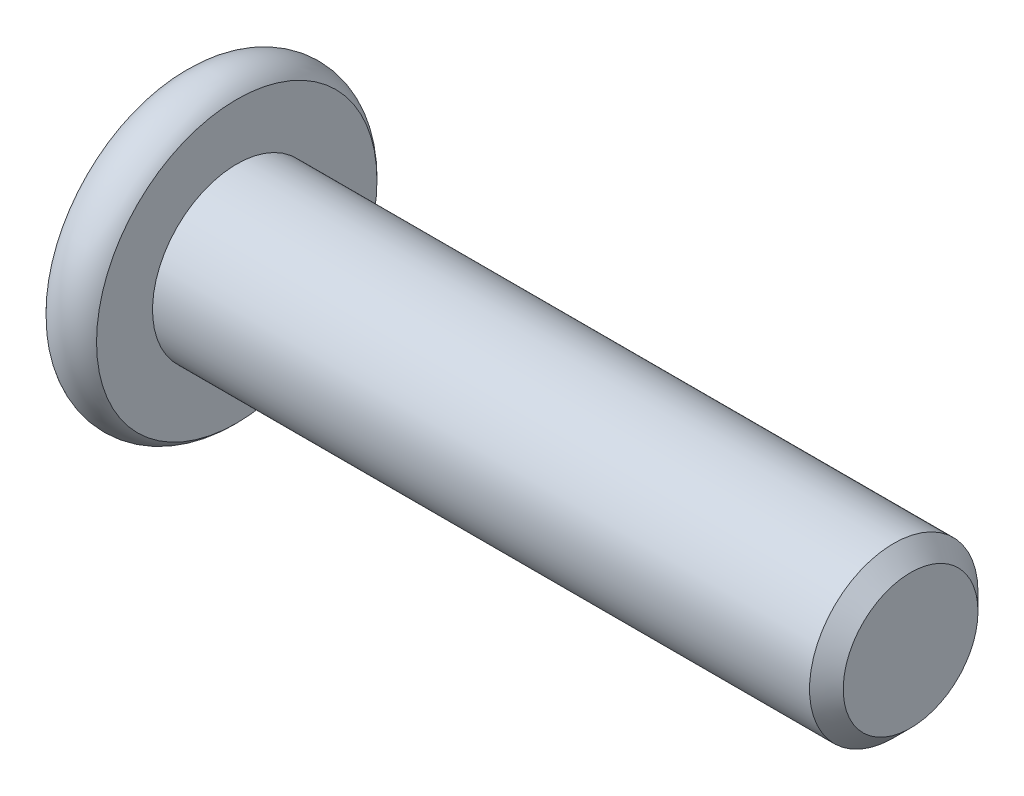
ISO-10303-21;
HEADER;
FILE_DESCRIPTION(('STEP AP214'),'2;1');
FILE_NAME('part.step','',(''),(''),'','','');
FILE_SCHEMA(('AUTOMOTIVE_DESIGN { 1 0 10303 214 1 1 1 1 }'));
ENDSEC;
DATA;
#1=APPLICATION_CONTEXT('core data for automotive mechanical design processes');
#2=APPLICATION_PROTOCOL_DEFINITION('international standard','automotive_design',2000,#1);
#3=PRODUCT_CONTEXT('',#1,'mechanical');
#4=PRODUCT('Part','Part','',(#3));
#5=PRODUCT_RELATED_PRODUCT_CATEGORY('part','',(#4));
#6=PRODUCT_DEFINITION_FORMATION('','',#4);
#7=PRODUCT_DEFINITION_CONTEXT('part definition',#1,'design');
#8=PRODUCT_DEFINITION('design','',#6,#7);
#9=PRODUCT_DEFINITION_SHAPE('','',#8);
#10=(LENGTH_UNIT() NAMED_UNIT(*) SI_UNIT(.MILLI.,.METRE.));
#11=(NAMED_UNIT(*) PLANE_ANGLE_UNIT() SI_UNIT($,.RADIAN.));
#12=(NAMED_UNIT(*) SI_UNIT($,.STERADIAN.) SOLID_ANGLE_UNIT());
#13=UNCERTAINTY_MEASURE_WITH_UNIT(LENGTH_MEASURE(1.E-05),#10,'distance_accuracy_value','');
#14=(GEOMETRIC_REPRESENTATION_CONTEXT(3) GLOBAL_UNCERTAINTY_ASSIGNED_CONTEXT((#13)) GLOBAL_UNIT_ASSIGNED_CONTEXT((#10,
#11,#12)) REPRESENTATION_CONTEXT('',''));
#15=CARTESIAN_POINT('',(0.,0.,0.));
#16=DIRECTION('',(0.,0.,1.));
#17=DIRECTION('',(1.,0.,0.));
#18=AXIS2_PLACEMENT_3D('',#15,#16,#17);
#19=CARTESIAN_POINT('',(-20.,0.,0.));
#20=DIRECTION('',(1.,0.,0.));
#21=DIRECTION('',(0.,0.,-1.));
#22=AXIS2_PLACEMENT_3D('',#19,#20,#21);
#23=CYLINDRICAL_SURFACE('',#22,2.5);
#24=CARTESIAN_POINT('',(-0.5,0.,0.));
#25=DIRECTION('',(1.,0.,0.));
#26=DIRECTION('',(0.,0.,-1.));
#27=AXIS2_PLACEMENT_3D('',#24,#25,#26);
#28=CIRCLE('',#27,2.5);
#29=CARTESIAN_POINT('',(-0.5,0.,-2.5));
#30=VERTEX_POINT('',#29);
#31=EDGE_CURVE('E47',#30,#30,#28,.F.);
#32=ORIENTED_EDGE('',*,*,#31,.T.);
#33=EDGE_LOOP('',(#32));
#34=FACE_BOUND('',#33,.T.);
#35=CARTESIAN_POINT('',(-20.,0.,0.));
#36=DIRECTION('',(-1.,0.,0.));
#37=DIRECTION('',(0.,-1.,0.));
#38=AXIS2_PLACEMENT_3D('',#35,#36,#37);
#39=CIRCLE('',#38,2.5);
#40=CARTESIAN_POINT('',(-20.,-2.50000000000001,0.));
#41=VERTEX_POINT('',#40);
#42=EDGE_CURVE('E123',#41,#41,#39,.F.);
#43=ORIENTED_EDGE('',*,*,#42,.T.);
#44=EDGE_LOOP('',(#43));
#45=FACE_BOUND('',#44,.T.);
#46=ADVANCED_FACE('F34',(#34,#45),#23,.T.);
#47=CARTESIAN_POINT('',(0.,0.,0.));
#48=DIRECTION('',(1.,0.,0.));
#49=DIRECTION('',(0.,0.,-1.));
#50=AXIS2_PLACEMENT_3D('',#47,#48,#49);
#51=PLANE('',#50);
#52=CARTESIAN_POINT('',(0.,0.,0.));
#53=DIRECTION('',(1.,0.,0.));
#54=DIRECTION('',(0.,0.,-1.));
#55=AXIS2_PLACEMENT_3D('',#52,#53,#54);
#56=CIRCLE('',#55,2.);
#57=CARTESIAN_POINT('',(0.,0.,-2.));
#58=VERTEX_POINT('',#57);
#59=EDGE_CURVE('E126',#58,#58,#56,.T.);
#60=ORIENTED_EDGE('',*,*,#59,.T.);
#61=EDGE_LOOP('',(#60));
#62=FACE_BOUND('',#61,.T.);
#63=ADVANCED_FACE('F136',(#62),#51,.T.);
#64=CARTESIAN_POINT('',(0.,0.,0.));
#65=DIRECTION('',(-1.,0.,0.));
#66=DIRECTION('',(0.,0.,1.));
#67=AXIS2_PLACEMENT_3D('',#64,#65,#66);
#68=CONICAL_SURFACE('',#67,2.,0.785398163397446);
#69=ORIENTED_EDGE('',*,*,#31,.F.);
#70=EDGE_LOOP('',(#69));
#71=FACE_BOUND('',#70,.T.);
#72=ORIENTED_EDGE('',*,*,#59,.F.);
#73=EDGE_LOOP('',(#72));
#74=FACE_BOUND('',#73,.T.);
#75=ADVANCED_FACE('F36',(#71,#74),#68,.T.);
#76=CARTESIAN_POINT('',(-21.5,0.,0.));
#77=DIRECTION('',(1.,0.,0.));
#78=DIRECTION('',(0.,1.,0.));
#79=AXIS2_PLACEMENT_3D('',#76,#77,#78);
#80=PLANE('',#79);
#81=CARTESIAN_POINT('',(-21.5,0.,0.));
#82=DIRECTION('',(-1.,0.,0.));
#83=DIRECTION('',(0.,-1.,0.));
#84=AXIS2_PLACEMENT_3D('',#81,#82,#83);
#85=CIRCLE('',#84,1.78205080756886);
#86=CARTESIAN_POINT('',(-21.5,-1.78205080756877,0.));
#87=VERTEX_POINT('',#86);
#88=EDGE_CURVE('E236',#87,#87,#85,.T.);
#89=ORIENTED_EDGE('',*,*,#88,.F.);
#90=EDGE_LOOP('',(#89));
#91=FACE_BOUND('',#90,.T.);
#92=CARTESIAN_POINT('',(-21.5,0.,0.));
#93=DIRECTION('',(-1.,0.,0.));
#94=DIRECTION('',(0.,-1.,0.));
#95=AXIS2_PLACEMENT_3D('',#92,#93,#94);
#96=CIRCLE('',#95,4.16143782776615);
#97=CARTESIAN_POINT('',(-21.5,-4.16143782776614,0.));
#98=VERTEX_POINT('',#97);
#99=EDGE_CURVE('E120',#98,#98,#96,.T.);
#100=ORIENTED_EDGE('',*,*,#99,.T.);
#101=EDGE_LOOP('',(#100));
#102=FACE_BOUND('',#101,.T.);
#103=ADVANCED_FACE('F135',(#91,#102),#80,.F.);
#104=CARTESIAN_POINT('',(-20.75,0.,0.));
#105=DIRECTION('',(-1.,0.,0.));
#106=DIRECTION('',(0.,-1.,0.));
#107=AXIS2_PLACEMENT_3D('',#104,#105,#106);
#108=TOROIDAL_SURFACE('',#107,3.5,1.);
#109=ORIENTED_EDGE('',*,*,#99,.F.);
#110=EDGE_LOOP('',(#109));
#111=FACE_BOUND('',#110,.T.);
#112=CARTESIAN_POINT('',(-20.,0.,0.));
#113=DIRECTION('',(-1.,0.,0.));
#114=DIRECTION('',(0.,-1.,0.));
#115=AXIS2_PLACEMENT_3D('',#112,#113,#114);
#116=CIRCLE('',#115,4.16143782776615);
#117=CARTESIAN_POINT('',(-20.,-4.16143782776615,0.));
#118=VERTEX_POINT('',#117);
#119=EDGE_CURVE('E117',#118,#118,#116,.T.);
#120=ORIENTED_EDGE('',*,*,#119,.T.);
#121=EDGE_LOOP('',(#120));
#122=FACE_BOUND('',#121,.T.);
#123=ADVANCED_FACE('F147',(#111,#122),#108,.T.);
#124=CARTESIAN_POINT('',(-20.,4.16143782776615,0.));
#125=DIRECTION('',(-1.,0.,0.));
#126=DIRECTION('',(0.,-1.,0.));
#127=AXIS2_PLACEMENT_3D('',#124,#125,#126);
#128=PLANE('',#127);
#129=ORIENTED_EDGE('',*,*,#42,.F.);
#130=EDGE_LOOP('',(#129));
#131=FACE_BOUND('',#130,.T.);
#132=ORIENTED_EDGE('',*,*,#119,.F.);
#133=EDGE_LOOP('',(#132));
#134=FACE_BOUND('',#133,.T.);
#135=ADVANCED_FACE('F151',(#131,#134),#128,.F.);
#136=CARTESIAN_POINT('',(-21.5,0.,0.));
#137=DIRECTION('',(-1.,0.,0.));
#138=DIRECTION('',(0.,-1.,0.));
#139=AXIS2_PLACEMENT_3D('',#136,#137,#138);
#140=CONICAL_SURFACE('',#139,1.78205080756886,0.78539816339745);
#141=ORIENTED_EDGE('',*,*,#88,.T.);
#142=EDGE_LOOP('',(#141));
#143=FACE_BOUND('',#142,.T.);
#144=CARTESIAN_POINT('',(-22.015428085613,-1.74023253176573,1.5));
#145=CARTESIAN_POINT('',(-21.9833811073445,-1.69791724929727,1.5));
#146=CARTESIAN_POINT('',(-21.9516444672841,-1.65536760966788,1.5));
#147=CARTESIAN_POINT('',(-21.8889203936153,-1.56970398156681,1.5));
#148=CARTESIAN_POINT('',(-21.85793314822,-1.52658985542845,1.5));
#149=CARTESIAN_POINT('',(-21.765846164345,-1.39562626326559,1.5));
#150=CARTESIAN_POINT('',(-21.7061145123021,-1.30679868010572,1.5));
#151=CARTESIAN_POINT('',(-21.5887342891012,-1.12044622640211,1.5));
#152=CARTESIAN_POINT('',(-21.5314082774823,-1.02271587306669,1.5));
#153=CARTESIAN_POINT('',(-21.426463214976,-0.822357214965219,1.5));
#154=CARTESIAN_POINT('',(-21.3788114236896,-0.719746931701882,1.5));
#155=CARTESIAN_POINT('',(-21.320509988315,-0.565852387095054,1.5));
#156=CARTESIAN_POINT('',(-21.3037990535409,-0.516874191424642,1.5));
#157=CARTESIAN_POINT('',(-21.2743077515089,-0.41772398845748,1.5));
#158=CARTESIAN_POINT('',(-21.2615276514219,-0.367551900263847,1.5));
#159=CARTESIAN_POINT('',(-21.2407784202458,-0.267158299056097,1.5));
#160=CARTESIAN_POINT('',(-21.2327260618259,-0.216954261864833,1.5));
#161=CARTESIAN_POINT('',(-21.221591636834,-0.115994915871297,1.5));
#162=CARTESIAN_POINT('',(-21.2185086886377,-0.0652397064615148,1.5));
#163=CARTESIAN_POINT('',(-21.2175473897404,0.0344222234875812,1.5));
#164=CARTESIAN_POINT('',(-21.2194789216952,0.0833271701101152,1.5));
#165=CARTESIAN_POINT('',(-21.2280175729677,0.180724293127248,1.5));
#166=CARTESIAN_POINT('',(-21.234625142048,0.229216429361756,1.5));
#167=CARTESIAN_POINT('',(-21.2522650626447,0.326258027697034,1.5));
#168=CARTESIAN_POINT('',(-21.263373168201,0.374793507450053,1.5));
#169=CARTESIAN_POINT('',(-21.2894198669595,0.470802295834207,1.5));
#170=CARTESIAN_POINT('',(-21.3043581560035,0.518275688481311,1.5));
#171=CARTESIAN_POINT('',(-21.356839545716,0.667150562065161,1.5));
#172=CARTESIAN_POINT('',(-21.4003351165442,0.766448362426881,1.5));
#173=CARTESIAN_POINT('',(-21.4970587814836,0.960384405673869,1.5));
#174=CARTESIAN_POINT('',(-21.5503217226675,1.05500437383624,1.5));
#175=CARTESIAN_POINT('',(-21.6602258010453,1.23584520321535,1.5));
#176=CARTESIAN_POINT('',(-21.7165682531046,1.32224986946553,1.5));
#177=CARTESIAN_POINT('',(-21.803675572597,1.44954953726477,1.5));
#178=CARTESIAN_POINT('',(-21.8330199906839,1.49143368482427,1.5));
#179=CARTESIAN_POINT('',(-21.8924869182931,1.57462914783248,1.5));
#180=CARTESIAN_POINT('',(-21.9226092115007,1.61594061772583,1.5));
#181=CARTESIAN_POINT('',(-21.9530541181366,1.65701358742556,1.5));
#182=B_SPLINE_CURVE_WITH_KNOTS('',3,(#144,#145,#146,#147,#148,#149,#150,#151,#152,#153,#154,
#155,#156,#157,#158,#159,#160,#161,#162,#163,#164,#165,#166,#167,#168,#169,#170,#171,#172,#173,
#174,#175,#176,#177,#178,#179,#180,#181),.UNSPECIFIED.,.F.,.F.,(4,2,2,2,2,2,2,2,2,2,2,2,2,2,2,2,
2,2,4),(0.,0.159238974218354,0.318517535014543,0.639504781932386,0.979137893799193,
1.31760168934357,1.47272233841624,1.62785352839775,1.78016486537346,1.93244917778279,
2.07904486260297,2.22565464958332,2.37484213303399,2.52401777304039,2.84828365283775,
3.1737297566675,3.48303030530537,3.63644667013909,3.78982082222913),.UNSPECIFIED.);
#183=CARTESIAN_POINT('',(-21.45,-0.866025403784357,1.5));
#184=VERTEX_POINT('',#183);
#185=CARTESIAN_POINT('',(-21.45,0.866025403784521,1.5));
#186=VERTEX_POINT('',#185);
#187=EDGE_CURVE('E101',#184,#186,#182,.T.);
#188=ORIENTED_EDGE('',*,*,#187,.F.);
#189=CARTESIAN_POINT('',(-21.4501154816001,-1.73216627762263,-0.0002000000000008));
#190=CARTESIAN_POINT('',(-21.4203654760674,-1.70239359975907,0.0513677907370744));
#191=CARTESIAN_POINT('',(-21.3923624839103,-1.67212305186347,0.103797917665199));
#192=CARTESIAN_POINT('',(-21.3410892304402,-1.61039789003611,0.210709034055595));
#193=CARTESIAN_POINT('',(-21.3178475050444,-1.57893740312606,0.26520019581466));
#194=CARTESIAN_POINT('',(-21.2780337289922,-1.51549879897979,0.375079081357248));
#195=CARTESIAN_POINT('',(-21.2613615856709,-1.48353684526802,0.430438809095199));
#196=CARTESIAN_POINT('',(-21.2356744568181,-1.41890915196203,0.54237725747715));
#197=CARTESIAN_POINT('',(-21.2266402904789,-1.3862453878111,0.598952556553009));
#198=CARTESIAN_POINT('',(-21.2184890812269,-1.32995210095291,0.696455389516442));
#199=CARTESIAN_POINT('',(-21.2172822529892,-1.30639533311116,0.737256908280467));
#200=CARTESIAN_POINT('',(-21.2193140571623,-1.25932335290185,0.818787969615859));
#201=CARTESIAN_POINT('',(-21.2225536707483,-1.23580815085305,0.859517494314631));
#202=CARTESIAN_POINT('',(-21.233291985982,-1.18900414978418,0.940584402163417));
#203=CARTESIAN_POINT('',(-21.2407946530188,-1.16571558211711,0.980921384598289));
#204=CARTESIAN_POINT('',(-21.2596516119283,-1.11952932016327,1.06091833691403));
#205=CARTESIAN_POINT('',(-21.2710075570186,-1.09663179808778,1.10057800851621));
#206=CARTESIAN_POINT('',(-21.3047216475927,-1.0379815980969,1.20216313477449));
#207=CARTESIAN_POINT('',(-21.3296218490934,-1.00259267147457,1.26345855370969));
#208=CARTESIAN_POINT('',(-21.3716566532716,-0.950557780604292,1.35358562846331));
#209=CARTESIAN_POINT('',(-21.3864251535591,-0.933410759677065,1.38328513990772));
#210=CARTESIAN_POINT('',(-21.4173105659402,-0.899432101996325,1.44213790138375));
#211=CARTESIAN_POINT('',(-21.4334268341217,-0.882600319285629,1.47129140422064));
#212=CARTESIAN_POINT('',(-21.4501154816001,-0.865909933730519,1.5002));
#213=B_SPLINE_CURVE_WITH_KNOTS('',3,(#189,#190,#191,#192,#193,#194,#195,#196,#197,#198,#199,
#200,#201,#202,#203,#204,#205,#206,#207,#208,#209,#210,#211,#212),.UNSPECIFIED.,.F.,.F.,(4,2,2,
2,2,2,2,2,2,2,2,4),(0.,0.199829143693305,0.400822987382389,0.598623720538181,0.795926240188891,
0.937113067959883,1.07833105577193,1.21968061668222,1.36109089931055,1.58570969637566,
1.69770705470964,1.80965120737194),.UNSPECIFIED.);
#214=CARTESIAN_POINT('',(-21.45,-1.73205080756879,0.));
#215=VERTEX_POINT('',#214);
#216=EDGE_CURVE('E193',#215,#184,#213,.T.);
#217=ORIENTED_EDGE('',*,*,#216,.F.);
#218=CARTESIAN_POINT('',(-21.4501154816001,-0.865909933730519,-1.5002));
#219=CARTESIAN_POINT('',(-21.4203654760674,-0.895682611594084,-1.44863220926292));
#220=CARTESIAN_POINT('',(-21.3923624839103,-0.925953159489683,-1.3962020823348));
#221=CARTESIAN_POINT('',(-21.3410892304402,-0.987678321317041,-1.2892909659444));
#222=CARTESIAN_POINT('',(-21.3178475050444,-1.01913880822709,-1.23479980418534));
#223=CARTESIAN_POINT('',(-21.2780337289922,-1.08257741237336,-1.12492091864275));
#224=CARTESIAN_POINT('',(-21.2613615856709,-1.11453936608513,-1.0695611909048));
#225=CARTESIAN_POINT('',(-21.2356744568181,-1.17916705939112,-0.957622742522851));
#226=CARTESIAN_POINT('',(-21.2266402904789,-1.21183082354205,-0.901047443446993));
#227=CARTESIAN_POINT('',(-21.2184890812269,-1.26812411040024,-0.80354461048356));
#228=CARTESIAN_POINT('',(-21.2172822529892,-1.291680878242,-0.762743091719535));
#229=CARTESIAN_POINT('',(-21.2193140571623,-1.3387528584513,-0.681212030384143));
#230=CARTESIAN_POINT('',(-21.2225536707483,-1.3622680605001,-0.640482505685371));
#231=CARTESIAN_POINT('',(-21.233291985982,-1.40907206156897,-0.559415597836585));
#232=CARTESIAN_POINT('',(-21.2407946530188,-1.43236062923604,-0.519078615401714));
#233=CARTESIAN_POINT('',(-21.2596516119283,-1.47854689118988,-0.439081663085971));
#234=CARTESIAN_POINT('',(-21.2710075570186,-1.50144441326537,-0.399421991483794));
#235=CARTESIAN_POINT('',(-21.3047216475927,-1.56009461325625,-0.297836865225517));
#236=CARTESIAN_POINT('',(-21.3296218490934,-1.59548353987858,-0.236541446290313));
#237=CARTESIAN_POINT('',(-21.3716566532716,-1.64751843074886,-0.146414371536688));
#238=CARTESIAN_POINT('',(-21.3864251535591,-1.66466545167609,-0.116714860092285));
#239=CARTESIAN_POINT('',(-21.4173105659402,-1.69864410935683,-0.0578620986162509));
#240=CARTESIAN_POINT('',(-21.4334268341217,-1.71547589206752,-0.0287085957793639));
#241=CARTESIAN_POINT('',(-21.4501154816001,-1.73216627762263,0.00019999999999943));
#242=B_SPLINE_CURVE_WITH_KNOTS('',3,(#218,#219,#220,#221,#222,#223,#224,#225,#226,#227,#228,
#229,#230,#231,#232,#233,#234,#235,#236,#237,#238,#239,#240,#241),.UNSPECIFIED.,.F.,.F.,(4,2,2,
2,2,2,2,2,2,2,2,4),(0.,0.199829143693304,0.400822987382386,0.598623720538178,0.795926240188888,
0.937113067959879,1.07833105577193,1.21968061668222,1.36109089931054,1.58570969637565,
1.69770705470963,1.80965120737194),.UNSPECIFIED.);
#243=CARTESIAN_POINT('',(-21.45,-0.866025403784356,-1.5));
#244=VERTEX_POINT('',#243);
#245=EDGE_CURVE('E188',#244,#215,#242,.T.);
#246=ORIENTED_EDGE('',*,*,#245,.F.);
#247=CARTESIAN_POINT('',(-22.0154280857208,-1.74023253190806,-1.5));
#248=CARTESIAN_POINT('',(-21.9833811074482,-1.69791724943558,-1.5));
#249=CARTESIAN_POINT('',(-21.9516444673836,-1.65536760980217,-1.5));
#250=CARTESIAN_POINT('',(-21.8889203937065,-1.569703981693,-1.5));
#251=CARTESIAN_POINT('',(-21.8579331483071,-1.52658985555058,-1.5));
#252=CARTESIAN_POINT('',(-21.7658461644196,-1.39562626337528,-1.5));
#253=CARTESIAN_POINT('',(-21.7061145123685,-1.30679868020694,-1.5));
#254=CARTESIAN_POINT('',(-21.5887342891506,-1.12044622648488,-1.5));
#255=CARTESIAN_POINT('',(-21.5314082775229,-1.02271587313942,-1.5));
#256=CARTESIAN_POINT('',(-21.4264632150005,-0.822357215017008,-1.5));
#257=CARTESIAN_POINT('',(-21.3788114237068,-0.719746931742781,-1.5));
#258=CARTESIAN_POINT('',(-21.3205099883267,-0.565852387127772,-1.5));
#259=CARTESIAN_POINT('',(-21.3037990535528,-0.516874191460807,-1.5));
#260=CARTESIAN_POINT('',(-21.2743077515206,-0.417723988500656,-1.5));
#261=CARTESIAN_POINT('',(-21.2615276514332,-0.367551900310585,-1.5));
#262=CARTESIAN_POINT('',(-21.2407784202553,-0.267158299109846,-1.5));
#263=CARTESIAN_POINT('',(-21.2327260618343,-0.216954261922027,-1.5));
#264=CARTESIAN_POINT('',(-21.2215916368391,-0.11599491593527,-1.5));
#265=CARTESIAN_POINT('',(-21.2185086886407,-0.0652397065288216,-1.5));
#266=CARTESIAN_POINT('',(-21.2175473897388,0.0344222234142057,-1.5));
#267=CARTESIAN_POINT('',(-21.219478921691,0.0833271700339959,-1.5));
#268=CARTESIAN_POINT('',(-21.228017572958,0.18072429304592,-1.5));
#269=CARTESIAN_POINT('',(-21.2346251420354,0.229216429277964,-1.5));
#270=CARTESIAN_POINT('',(-21.2522650626259,0.326258027608378,-1.5));
#271=CARTESIAN_POINT('',(-21.2633731681789,0.374793507359005,-1.5));
#272=CARTESIAN_POINT('',(-21.2894198669309,0.470802295738608,-1.5));
#273=CARTESIAN_POINT('',(-21.3043581559716,0.518275688383553,-1.5));
#274=CARTESIAN_POINT('',(-21.3568395456685,0.667150561946207,-1.5));
#275=CARTESIAN_POINT('',(-21.4003351164824,0.766448362289951,-1.5));
#276=CARTESIAN_POINT('',(-21.4970587813916,0.960384405502367,-1.5));
#277=CARTESIAN_POINT('',(-21.5503217225595,1.05500437364815,-1.5));
#278=CARTESIAN_POINT('',(-21.6602258009069,1.23584520299745,-1.5));
#279=CARTESIAN_POINT('',(-21.7165682529518,1.32224986923429,-1.5));
#280=CARTESIAN_POINT('',(-21.8036755724226,1.44954953701381,-1.5));
#281=CARTESIAN_POINT('',(-21.8330199905024,1.49143368456684,-1.5));
#282=CARTESIAN_POINT('',(-21.8924869180973,1.57462914756214,-1.5));
#283=CARTESIAN_POINT('',(-21.9226092112979,1.61594061744905,-1.5));
#284=CARTESIAN_POINT('',(-21.9530541179266,1.65701358714236,-1.5));
#285=B_SPLINE_CURVE_WITH_KNOTS('',3,(#247,#248,#249,#250,#251,#252,#253,#254,#255,#256,#257,
#258,#259,#260,#261,#262,#263,#264,#265,#266,#267,#268,#269,#270,#271,#272,#273,#274,#275,#276,
#277,#278,#279,#280,#281,#282,#283,#284),.UNSPECIFIED.,.F.,.F.,(4,2,2,2,2,2,2,2,2,2,2,2,2,2,2,2,
2,2,4),(0.,0.159238974235481,0.318517535048797,0.63950478200154,0.979137893907506,
1.31760168949067,1.47272233855334,1.62785352852489,1.78016486549104,1.93244917789081,
2.0790448627025,2.22565464967435,2.37484213311584,2.52401777311309,2.8482836528441,
3.17372975660706,3.4830303051878,3.63644666999334,3.78982082205521),.UNSPECIFIED.);
#286=CARTESIAN_POINT('',(-21.45,0.866025403784521,-1.5));
#287=VERTEX_POINT('',#286);
#288=EDGE_CURVE('E54',#287,#244,#285,.F.);
#289=ORIENTED_EDGE('',*,*,#288,.F.);
#290=CARTESIAN_POINT('',(-21.4501154816001,1.7321662776228,0.00020000000000003));
#291=CARTESIAN_POINT('',(-21.4203654760673,1.70239359975923,-0.0513677907370759));
#292=CARTESIAN_POINT('',(-21.3923624839103,1.67212305186363,-0.103797917665201));
#293=CARTESIAN_POINT('',(-21.3410892304402,1.61039789003627,-0.210709034055597));
#294=CARTESIAN_POINT('',(-21.3178475050444,1.57893740312622,-0.265200195814661));
#295=CARTESIAN_POINT('',(-21.2780337289922,1.51549879897995,-0.375079081357247));
#296=CARTESIAN_POINT('',(-21.2613615856709,1.48353684526818,-0.430438809095198));
#297=CARTESIAN_POINT('',(-21.2356744568181,1.4189091519622,-0.542377257477149));
#298=CARTESIAN_POINT('',(-21.2266402904789,1.38624538781127,-0.598952556553007));
#299=CARTESIAN_POINT('',(-21.2184890812269,1.32995210095308,-0.696455389516439));
#300=CARTESIAN_POINT('',(-21.2172822529892,1.30639533311132,-0.737256908280464));
#301=CARTESIAN_POINT('',(-21.2193140571623,1.25932335290202,-0.818787969615856));
#302=CARTESIAN_POINT('',(-21.2225536707483,1.23580815085322,-0.859517494314628));
#303=CARTESIAN_POINT('',(-21.233291985982,1.18900414978435,-0.940584402163414));
#304=CARTESIAN_POINT('',(-21.2407946530187,1.16571558211728,-0.980921384598287));
#305=CARTESIAN_POINT('',(-21.2596516119283,1.11952932016343,-1.06091833691403));
#306=CARTESIAN_POINT('',(-21.2710075570186,1.09663179808795,-1.10057800851621));
#307=CARTESIAN_POINT('',(-21.3047216475927,1.03798159809707,-1.20216313477448));
#308=CARTESIAN_POINT('',(-21.3296218490934,1.00259267147474,-1.26345855370969));
#309=CARTESIAN_POINT('',(-21.3716566532716,0.950557780604457,-1.35358562846331));
#310=CARTESIAN_POINT('',(-21.3864251535591,0.93341075967723,-1.38328513990772));
#311=CARTESIAN_POINT('',(-21.4173105659402,0.89943210199649,-1.44213790138375));
#312=CARTESIAN_POINT('',(-21.4334268341217,0.882600319285793,-1.47129140422064));
#313=CARTESIAN_POINT('',(-21.4501154816001,0.865909933730683,-1.5002));
#314=B_SPLINE_CURVE_WITH_KNOTS('',3,(#290,#291,#292,#293,#294,#295,#296,#297,#298,#299,#300,
#301,#302,#303,#304,#305,#306,#307,#308,#309,#310,#311,#312,#313),.UNSPECIFIED.,.F.,.F.,(4,2,2,
2,2,2,2,2,2,2,2,4),(0.,0.199829143693305,0.400822987382387,0.598623720538179,0.795926240188887,
0.937113067959879,1.07833105577193,1.21968061668222,1.36109089931054,1.58570969637565,
1.69770705470963,1.80965120737194),.UNSPECIFIED.);
#315=CARTESIAN_POINT('',(-21.45,1.73205080756896,0.));
#316=VERTEX_POINT('',#315);
#317=EDGE_CURVE('E11',#316,#287,#314,.T.);
#318=ORIENTED_EDGE('',*,*,#317,.F.);
#319=CARTESIAN_POINT('',(-21.4501154816001,0.865909933730683,1.5002));
#320=CARTESIAN_POINT('',(-21.4203654760673,0.895682611594248,1.44863220926292));
#321=CARTESIAN_POINT('',(-21.3923624839103,0.925953159489847,1.3962020823348));
#322=CARTESIAN_POINT('',(-21.3410892304402,0.987678321317206,1.2892909659444));
#323=CARTESIAN_POINT('',(-21.3178475050444,1.01913880822726,1.23479980418534));
#324=CARTESIAN_POINT('',(-21.2780337289922,1.08257741237353,1.12492091864275));
#325=CARTESIAN_POINT('',(-21.2613615856709,1.1145393660853,1.0695611909048));
#326=CARTESIAN_POINT('',(-21.2356744568181,1.17916705939129,0.957622742522847));
#327=CARTESIAN_POINT('',(-21.2266402904789,1.21183082354222,0.901047443446989));
#328=CARTESIAN_POINT('',(-21.2184890812269,1.2681241104004,0.803544610483557));
#329=CARTESIAN_POINT('',(-21.2172822529892,1.29168087824216,0.762743091719531));
#330=CARTESIAN_POINT('',(-21.2193140571623,1.33875285845146,0.681212030384139));
#331=CARTESIAN_POINT('',(-21.2225536707483,1.36226806050027,0.640482505685368));
#332=CARTESIAN_POINT('',(-21.233291985982,1.40907206156913,0.559415597836582));
#333=CARTESIAN_POINT('',(-21.2407946530187,1.4323606292362,0.51907861540171));
#334=CARTESIAN_POINT('',(-21.2596516119283,1.47854689119005,0.439081663085967));
#335=CARTESIAN_POINT('',(-21.2710075570186,1.50144441326554,0.39942199148379));
#336=CARTESIAN_POINT('',(-21.3047216475927,1.56009461325641,0.297836865225514));
#337=CARTESIAN_POINT('',(-21.3296218490934,1.59548353987875,0.23654144629031));
#338=CARTESIAN_POINT('',(-21.3716566532716,1.64751843074902,0.146414371536686));
#339=CARTESIAN_POINT('',(-21.3864251535591,1.66466545167625,0.116714860092283));
#340=CARTESIAN_POINT('',(-21.4173105659402,1.69864410935699,0.05786209861625));
#341=CARTESIAN_POINT('',(-21.4334268341217,1.71547589206769,0.0287085957793637));
#342=CARTESIAN_POINT('',(-21.4501154816001,1.7321662776228,-0.000199999999999372));
#343=B_SPLINE_CURVE_WITH_KNOTS('',3,(#319,#320,#321,#322,#323,#324,#325,#326,#327,#328,#329,
#330,#331,#332,#333,#334,#335,#336,#337,#338,#339,#340,#341,#342),.UNSPECIFIED.,.F.,.F.,(4,2,2,
2,2,2,2,2,2,2,2,4),(0.,0.199829143693306,0.40082298738239,0.598623720538183,0.795926240188891,
0.937113067959883,1.07833105577193,1.21968061668222,1.36109089931055,1.58570969637565,
1.69770705470963,1.80965120737193),.UNSPECIFIED.);
#344=EDGE_CURVE('E92',#186,#316,#343,.T.);
#345=ORIENTED_EDGE('',*,*,#344,.F.);
#346=EDGE_LOOP('',(#188,#217,#246,#289,#318,#345));
#347=FACE_BOUND('',#346,.T.);
#348=ADVANCED_FACE('F91',(#143,#347),#140,.F.);
#349=CARTESIAN_POINT('',(-19.2,0.,0.));
#350=DIRECTION('',(-1.,0.,0.));
#351=DIRECTION('',(0.,-1.,0.));
#352=AXIS2_PLACEMENT_3D('',#349,#350,#351);
#353=PLANE('',#352);
#354=DIRECTION('',(0.,0.5,-0.866025403784438));
#355=VECTOR('',#354,1.);
#356=CARTESIAN_POINT('',(-19.2,0.866025403784512,1.5));
#357=LINE('',#356,#355);
#358=CARTESIAN_POINT('',(-19.2,0.866025403784512,1.5));
#359=VERTEX_POINT('',#358);
#360=CARTESIAN_POINT('',(-19.2,1.73205080756895,0.));
#361=VERTEX_POINT('',#360);
#362=EDGE_CURVE('E100',#359,#361,#357,.T.);
#363=ORIENTED_EDGE('',*,*,#362,.T.);
#364=DIRECTION('',(0.,-0.5,-0.866025403784439));
#365=VECTOR('',#364,1.);
#366=CARTESIAN_POINT('',(-19.2,1.73205080756895,0.));
#367=LINE('',#366,#365);
#368=CARTESIAN_POINT('',(-19.2,0.866025403784512,-1.5));
#369=VERTEX_POINT('',#368);
#370=EDGE_CURVE('E105',#361,#369,#367,.T.);
#371=ORIENTED_EDGE('',*,*,#370,.T.);
#372=DIRECTION('',(0.,-1.,0.));
#373=VECTOR('',#372,1.);
#374=CARTESIAN_POINT('',(-19.2,0.866025403784512,-1.5));
#375=LINE('',#374,#373);
#376=CARTESIAN_POINT('',(-19.2,-0.866025403784365,-1.5));
#377=VERTEX_POINT('',#376);
#378=EDGE_CURVE('E218',#369,#377,#375,.T.);
#379=ORIENTED_EDGE('',*,*,#378,.T.);
#380=DIRECTION('',(0.,-0.5,0.866025403784439));
#381=VECTOR('',#380,1.);
#382=CARTESIAN_POINT('',(-19.2,-0.866025403784365,-1.5));
#383=LINE('',#382,#381);
#384=CARTESIAN_POINT('',(-19.2,-1.7320508075688,0.));
#385=VERTEX_POINT('',#384);
#386=EDGE_CURVE('E222',#377,#385,#383,.T.);
#387=ORIENTED_EDGE('',*,*,#386,.T.);
#388=DIRECTION('',(0.,0.5,0.866025403784439));
#389=VECTOR('',#388,1.);
#390=CARTESIAN_POINT('',(-19.2,-1.7320508075688,0.));
#391=LINE('',#390,#389);
#392=CARTESIAN_POINT('',(-19.2,-0.866025403784366,1.5));
#393=VERTEX_POINT('',#392);
#394=EDGE_CURVE('E113',#385,#393,#391,.T.);
#395=ORIENTED_EDGE('',*,*,#394,.T.);
#396=DIRECTION('',(0.,1.,0.));
#397=VECTOR('',#396,1.);
#398=CARTESIAN_POINT('',(-19.2,-0.866025403784366,1.5));
#399=LINE('',#398,#397);
#400=EDGE_CURVE('E108',#393,#359,#399,.T.);
#401=ORIENTED_EDGE('',*,*,#400,.T.);
#402=EDGE_LOOP('',(#363,#371,#379,#387,#395,#401));
#403=FACE_BOUND('',#402,.T.);
#404=ADVANCED_FACE('F175',(#403),#353,.T.);
#405=CARTESIAN_POINT('',(-19.2,1.73205080756895,0.));
#406=DIRECTION('',(0.,0.866025403784439,-0.5));
#407=DIRECTION('',(0.,0.5,0.866025403784439));
#408=AXIS2_PLACEMENT_3D('',#405,#406,#407);
#409=PLANE('',#408);
#410=DIRECTION('',(-1.,0.,0.));
#411=VECTOR('',#410,1.);
#412=CARTESIAN_POINT('',(-19.2,1.73205080756895,0.));
#413=LINE('',#412,#411);
#414=EDGE_CURVE('E98',#361,#316,#413,.T.);
#415=ORIENTED_EDGE('',*,*,#414,.T.);
#416=ORIENTED_EDGE('',*,*,#317,.T.);
#417=DIRECTION('',(-1.,0.,0.));
#418=VECTOR('',#417,1.);
#419=CARTESIAN_POINT('',(-19.2,0.866025403784512,-1.5));
#420=LINE('',#419,#418);
#421=EDGE_CURVE('E107',#369,#287,#420,.T.);
#422=ORIENTED_EDGE('',*,*,#421,.F.);
#423=ORIENTED_EDGE('',*,*,#370,.F.);
#424=EDGE_LOOP('',(#415,#416,#422,#423));
#425=FACE_BOUND('',#424,.T.);
#426=ADVANCED_FACE('F103',(#425),#409,.F.);
#427=CARTESIAN_POINT('',(-19.2,0.866025403784512,-1.5));
#428=DIRECTION('',(0.,0.,-1.));
#429=DIRECTION('',(0.,1.,0.));
#430=AXIS2_PLACEMENT_3D('',#427,#428,#429);
#431=PLANE('',#430);
#432=ORIENTED_EDGE('',*,*,#421,.T.);
#433=ORIENTED_EDGE('',*,*,#288,.T.);
#434=DIRECTION('',(-1.,0.,0.));
#435=VECTOR('',#434,1.);
#436=CARTESIAN_POINT('',(-19.2,-0.866025403784365,-1.5));
#437=LINE('',#436,#435);
#438=EDGE_CURVE('E110',#377,#244,#437,.T.);
#439=ORIENTED_EDGE('',*,*,#438,.F.);
#440=ORIENTED_EDGE('',*,*,#378,.F.);
#441=EDGE_LOOP('',(#432,#433,#439,#440));
#442=FACE_BOUND('',#441,.T.);
#443=ADVANCED_FACE('F207',(#442),#431,.F.);
#444=CARTESIAN_POINT('',(-19.2,-0.866025403784365,-1.5));
#445=DIRECTION('',(0.,-0.866025403784439,-0.5));
#446=DIRECTION('',(0.,0.5,-0.866025403784439));
#447=AXIS2_PLACEMENT_3D('',#444,#445,#446);
#448=PLANE('',#447);
#449=ORIENTED_EDGE('',*,*,#438,.T.);
#450=ORIENTED_EDGE('',*,*,#245,.T.);
#451=DIRECTION('',(-1.,0.,0.));
#452=VECTOR('',#451,1.);
#453=CARTESIAN_POINT('',(-19.2,-1.7320508075688,0.));
#454=LINE('',#453,#452);
#455=EDGE_CURVE('E232',#385,#215,#454,.T.);
#456=ORIENTED_EDGE('',*,*,#455,.F.);
#457=ORIENTED_EDGE('',*,*,#386,.F.);
#458=EDGE_LOOP('',(#449,#450,#456,#457));
#459=FACE_BOUND('',#458,.T.);
#460=ADVANCED_FACE('F202',(#459),#448,.F.);
#461=CARTESIAN_POINT('',(-19.2,-1.7320508075688,0.));
#462=DIRECTION('',(0.,-0.866025403784439,0.5));
#463=DIRECTION('',(0.,-0.5,-0.866025403784439));
#464=AXIS2_PLACEMENT_3D('',#461,#462,#463);
#465=PLANE('',#464);
#466=ORIENTED_EDGE('',*,*,#455,.T.);
#467=ORIENTED_EDGE('',*,*,#216,.T.);
#468=DIRECTION('',(-1.,0.,0.));
#469=VECTOR('',#468,1.);
#470=CARTESIAN_POINT('',(-19.2,-0.866025403784366,1.5));
#471=LINE('',#470,#469);
#472=EDGE_CURVE('E229',#393,#184,#471,.T.);
#473=ORIENTED_EDGE('',*,*,#472,.F.);
#474=ORIENTED_EDGE('',*,*,#394,.F.);
#475=EDGE_LOOP('',(#466,#467,#473,#474));
#476=FACE_BOUND('',#475,.T.);
#477=ADVANCED_FACE('F199',(#476),#465,.F.);
#478=CARTESIAN_POINT('',(-19.2,-0.866025403784366,1.5));
#479=DIRECTION('',(0.,0.,1.));
#480=DIRECTION('',(1.,0.,0.));
#481=AXIS2_PLACEMENT_3D('',#478,#479,#480);
#482=PLANE('',#481);
#483=ORIENTED_EDGE('',*,*,#472,.T.);
#484=ORIENTED_EDGE('',*,*,#187,.T.);
#485=DIRECTION('',(-1.,0.,0.));
#486=VECTOR('',#485,1.);
#487=CARTESIAN_POINT('',(-19.2,0.866025403784512,1.5));
#488=LINE('',#487,#486);
#489=EDGE_CURVE('E61',#359,#186,#488,.T.);
#490=ORIENTED_EDGE('',*,*,#489,.F.);
#491=ORIENTED_EDGE('',*,*,#400,.F.);
#492=EDGE_LOOP('',(#483,#484,#490,#491));
#493=FACE_BOUND('',#492,.T.);
#494=ADVANCED_FACE('F158',(#493),#482,.F.);
#495=CARTESIAN_POINT('',(-19.2,0.866025403784512,1.5));
#496=DIRECTION('',(0.,0.866025403784439,0.5));
#497=DIRECTION('',(0.,-0.5,0.866025403784439));
#498=AXIS2_PLACEMENT_3D('',#495,#496,#497);
#499=PLANE('',#498);
#500=ORIENTED_EDGE('',*,*,#489,.T.);
#501=ORIENTED_EDGE('',*,*,#344,.T.);
#502=ORIENTED_EDGE('',*,*,#414,.F.);
#503=ORIENTED_EDGE('',*,*,#362,.F.);
#504=EDGE_LOOP('',(#500,#501,#502,#503));
#505=FACE_BOUND('',#504,.T.);
#506=ADVANCED_FACE('F97',(#505),#499,.F.);
#507=CLOSED_SHELL('',(#46,#63,#75,#103,#123,#135,#348,#404,#426,#443,#460,#477,#494,#506));
#508=MANIFOLD_SOLID_BREP('B2',#507);
#509=ADVANCED_BREP_SHAPE_REPRESENTATION('',(#18,#508),#14);
#510=SHAPE_DEFINITION_REPRESENTATION(#9,#509);
ENDSEC;
END-ISO-10303-21;
